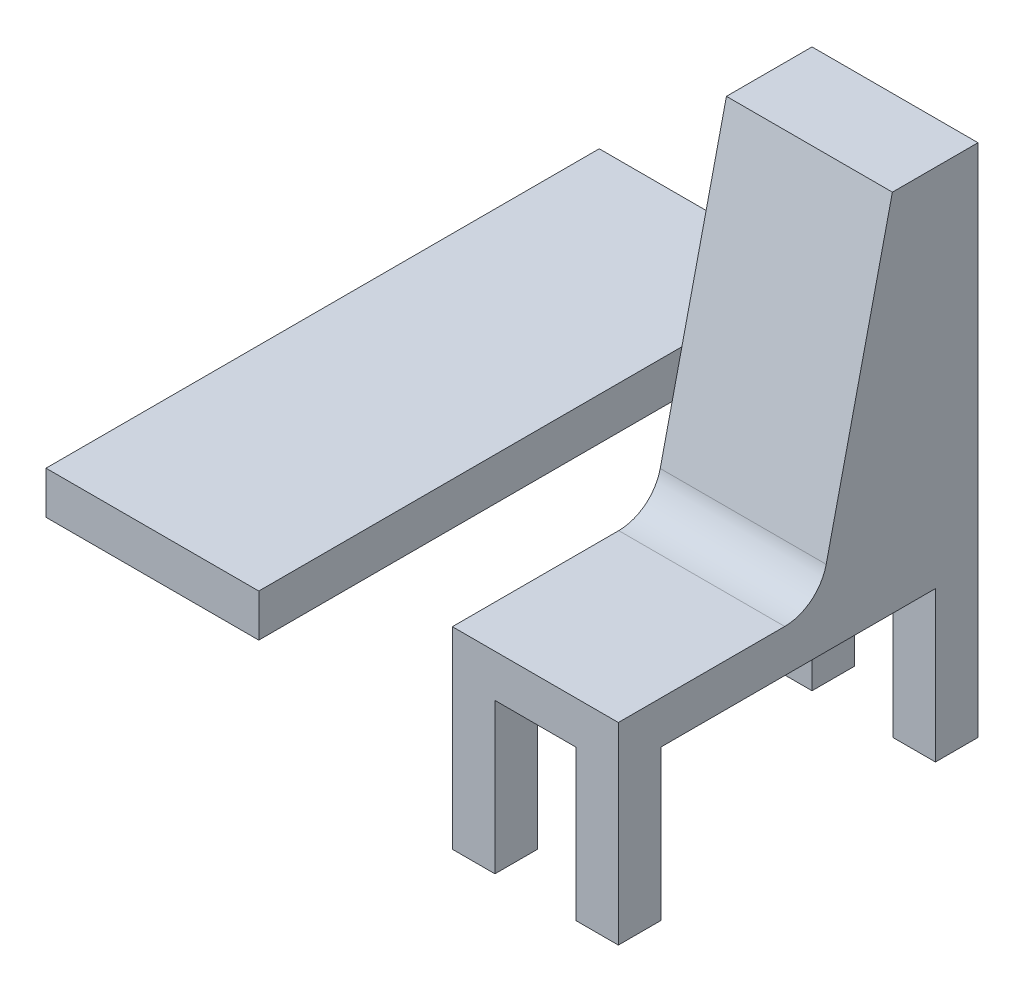
ISO-10303-21;
HEADER;
FILE_DESCRIPTION(('STEP AP214'),'2;1');
FILE_NAME('part.step','',(''),(''),'','','');
FILE_SCHEMA(('AUTOMOTIVE_DESIGN { 1 0 10303 214 1 1 1 1 }'));
ENDSEC;
DATA;
#1=APPLICATION_CONTEXT('core data for automotive mechanical design processes');
#2=APPLICATION_PROTOCOL_DEFINITION('international standard','automotive_design',2000,#1);
#3=PRODUCT_CONTEXT('',#1,'mechanical');
#4=PRODUCT('Part','Part','',(#3));
#5=PRODUCT_RELATED_PRODUCT_CATEGORY('part','',(#4));
#6=PRODUCT_DEFINITION_FORMATION('','',#4);
#7=PRODUCT_DEFINITION_CONTEXT('part definition',#1,'design');
#8=PRODUCT_DEFINITION('design','',#6,#7);
#9=PRODUCT_DEFINITION_SHAPE('','',#8);
#10=(LENGTH_UNIT() NAMED_UNIT(*) SI_UNIT(.MILLI.,.METRE.));
#11=(NAMED_UNIT(*) PLANE_ANGLE_UNIT() SI_UNIT($,.RADIAN.));
#12=(NAMED_UNIT(*) SI_UNIT($,.STERADIAN.) SOLID_ANGLE_UNIT());
#13=UNCERTAINTY_MEASURE_WITH_UNIT(LENGTH_MEASURE(1.E-05),#10,'distance_accuracy_value','');
#14=(GEOMETRIC_REPRESENTATION_CONTEXT(3) GLOBAL_UNCERTAINTY_ASSIGNED_CONTEXT((#13)) GLOBAL_UNIT_ASSIGNED_CONTEXT((#10,
#11,#12)) REPRESENTATION_CONTEXT('',''));
#15=CARTESIAN_POINT('',(0.,0.,0.));
#16=DIRECTION('',(0.,0.,1.));
#17=DIRECTION('',(1.,0.,0.));
#18=AXIS2_PLACEMENT_3D('',#15,#16,#17);
#19=CARTESIAN_POINT('',(-195.,0.,0.));
#20=DIRECTION('',(1.,0.,0.));
#21=DIRECTION('',(0.,0.,-1.));
#22=AXIS2_PLACEMENT_3D('',#19,#20,#21);
#23=PLANE('',#22);
#24=DIRECTION('',(0.,0.,-1.));
#25=VECTOR('',#24,1.);
#26=CARTESIAN_POINT('',(-195.,3.38208219918712,-455.543474797715));
#27=LINE('',#26,#25);
#28=CARTESIAN_POINT('',(-195.,3.38208219918712,-149.727423533533));
#29=VERTEX_POINT('',#28);
#30=CARTESIAN_POINT('',(-195.,3.38208219918712,-455.543474797715));
#31=VERTEX_POINT('',#30);
#32=EDGE_CURVE('E11',#29,#31,#27,.T.);
#33=ORIENTED_EDGE('',*,*,#32,.F.);
#34=DIRECTION('',(0.,-0.974799851771742,0.223081260947191));
#35=VECTOR('',#34,1.);
#36=CARTESIAN_POINT('',(-195.,460.678904739763,-254.379010845615));
#37=LINE('',#36,#35);
#38=CARTESIAN_POINT('',(-195.,460.678904739763,-254.379010845615));
#39=VERTEX_POINT('',#38);
#40=EDGE_CURVE('E307',#39,#29,#37,.T.);
#41=ORIENTED_EDGE('',*,*,#40,.F.);
#42=DIRECTION('',(0.,0.,1.));
#43=VECTOR('',#42,1.);
#44=CARTESIAN_POINT('',(-195.,460.678904739763,-455.543474797715));
#45=LINE('',#44,#43);
#46=CARTESIAN_POINT('',(-195.,460.678904739763,-455.543474797715));
#47=VERTEX_POINT('',#46);
#48=EDGE_CURVE('E274',#47,#39,#45,.T.);
#49=ORIENTED_EDGE('',*,*,#48,.F.);
#50=DIRECTION('',(0.,1.,0.));
#51=VECTOR('',#50,1.);
#52=CARTESIAN_POINT('',(-195.,-749.619649679448,-455.543474797715));
#53=LINE('',#52,#51);
#54=EDGE_CURVE('E50',#31,#47,#53,.T.);
#55=ORIENTED_EDGE('',*,*,#54,.F.);
#56=EDGE_LOOP('',(#33,#41,#49,#55));
#57=FACE_BOUND('',#56,.T.);
#58=ADVANCED_FACE('F33',(#57),#23,.F.);
#59=DIRECTION('',(0.,0.,1.));
#60=VECTOR('',#59,1.);
#61=CARTESIAN_POINT('',(-195.,-96.6179178008127,844.456525202285));
#62=LINE('',#61,#60);
#63=CARTESIAN_POINT('',(-195.,-96.6179178008129,-455.543474797715));
#64=VERTEX_POINT('',#63);
#65=CARTESIAN_POINT('',(-195.,-96.6179178008128,-126.842596402945));
#66=VERTEX_POINT('',#65);
#67=EDGE_CURVE('E57',#64,#66,#62,.T.);
#68=ORIENTED_EDGE('',*,*,#67,.F.);
#69=CARTESIAN_POINT('',(-195.,-749.619649679448,-455.543474797715));
#70=VERTEX_POINT('',#69);
#71=EDGE_CURVE('E219',#70,#64,#53,.T.);
#72=ORIENTED_EDGE('',*,*,#71,.F.);
#73=DIRECTION('',(0.,0.,-1.));
#74=VECTOR('',#73,1.);
#75=CARTESIAN_POINT('',(-195.,-749.619649679448,389.549913064427));
#76=LINE('',#75,#74);
#77=CARTESIAN_POINT('',(-195.,-749.619649679448,-355.543474797715));
#78=VERTEX_POINT('',#77);
#79=EDGE_CURVE('E316',#78,#70,#76,.T.);
#80=ORIENTED_EDGE('',*,*,#79,.F.);
#81=DIRECTION('',(0.,1.,0.));
#82=VECTOR('',#81,1.);
#83=CARTESIAN_POINT('',(-195.,0.,-355.543474797715));
#84=LINE('',#83,#82);
#85=CARTESIAN_POINT('',(-195.,-396.617917800813,-355.543474797715));
#86=VERTEX_POINT('',#85);
#87=EDGE_CURVE('E343',#78,#86,#84,.T.);
#88=ORIENTED_EDGE('',*,*,#87,.T.);
#89=DIRECTION('',(0.,0.,1.));
#90=VECTOR('',#89,1.);
#91=CARTESIAN_POINT('',(-195.,-396.617917800813,-1.02388511324065E-13));
#92=LINE('',#91,#90);
#93=CARTESIAN_POINT('',(-195.,-396.617917800813,289.549913064427));
#94=VERTEX_POINT('',#93);
#95=EDGE_CURVE('E340',#86,#94,#92,.T.);
#96=ORIENTED_EDGE('',*,*,#95,.T.);
#97=DIRECTION('',(0.,-1.,0.));
#98=VECTOR('',#97,1.);
#99=CARTESIAN_POINT('',(-195.,0.,289.549913064427));
#100=LINE('',#99,#98);
#101=CARTESIAN_POINT('',(-195.,-749.619649679448,289.549913064427));
#102=VERTEX_POINT('',#101);
#103=EDGE_CURVE('E337',#94,#102,#100,.T.);
#104=ORIENTED_EDGE('',*,*,#103,.T.);
#105=CARTESIAN_POINT('',(-195.,-749.619649679448,389.549913064427));
#106=VERTEX_POINT('',#105);
#107=EDGE_CURVE('E317',#106,#102,#76,.T.);
#108=ORIENTED_EDGE('',*,*,#107,.F.);
#109=DIRECTION('',(0.,-1.,0.));
#110=VECTOR('',#109,1.);
#111=CARTESIAN_POINT('',(-195.,-296.617917800813,389.549913064427));
#112=LINE('',#111,#110);
#113=CARTESIAN_POINT('',(-195.,-296.617917800813,389.549913064427));
#114=VERTEX_POINT('',#113);
#115=EDGE_CURVE('E313',#114,#106,#112,.T.);
#116=ORIENTED_EDGE('',*,*,#115,.F.);
#117=DIRECTION('',(0.,0.,1.));
#118=VECTOR('',#117,1.);
#119=CARTESIAN_POINT('',(-195.,-296.617917800813,-81.0729421417686));
#120=LINE('',#119,#118);
#121=CARTESIAN_POINT('',(-195.,-296.617917800813,-1.37260800233228));
#122=VERTEX_POINT('',#121);
#123=EDGE_CURVE('E310',#122,#114,#120,.T.);
#124=ORIENTED_EDGE('',*,*,#123,.F.);
#125=CARTESIAN_POINT('',(-195.,-196.617917800813,-1.37260800233227));
#126=DIRECTION('',(1.,0.,0.));
#127=DIRECTION('',(0.,0.,-1.));
#128=AXIS2_PLACEMENT_3D('',#125,#126,#127);
#129=CIRCLE('',#128,100.);
#130=CARTESIAN_POINT('',(-195.,-218.926043895532,-98.8525931795066));
#131=VERTEX_POINT('',#130);
#132=EDGE_CURVE('E351',#122,#131,#129,.T.);
#133=ORIENTED_EDGE('',*,*,#132,.T.);
#134=EDGE_CURVE('E306',#66,#131,#37,.T.);
#135=ORIENTED_EDGE('',*,*,#134,.F.);
#136=EDGE_LOOP('',(#68,#72,#80,#88,#96,#104,#108,#116,#124,#133,#135));
#137=FACE_BOUND('',#136,.T.);
#138=ADVANCED_FACE('F372',(#137),#23,.F.);
#139=CARTESIAN_POINT('',(195.,-749.619649679448,389.549913064427));
#140=DIRECTION('',(0.,1.,0.));
#141=DIRECTION('',(0.,0.,1.));
#142=AXIS2_PLACEMENT_3D('',#139,#140,#141);
#143=PLANE('',#142);
#144=DIRECTION('',(-1.,0.,0.));
#145=VECTOR('',#144,1.);
#146=CARTESIAN_POINT('',(195.,-749.619649679448,-455.543474797715));
#147=LINE('',#146,#145);
#148=CARTESIAN_POINT('',(-95.0000000000001,-749.619649679448,-455.543474797715));
#149=VERTEX_POINT('',#148);
#150=EDGE_CURVE('E323',#149,#70,#147,.T.);
#151=ORIENTED_EDGE('',*,*,#150,.F.);
#152=DIRECTION('',(0.,0.,-1.));
#153=VECTOR('',#152,1.);
#154=CARTESIAN_POINT('',(-95.0000000000001,-749.619649679448,389.549913064427));
#155=LINE('',#154,#153);
#156=CARTESIAN_POINT('',(-95.0000000000001,-749.619649679448,-355.543474797715));
#157=VERTEX_POINT('',#156);
#158=EDGE_CURVE('E238',#157,#149,#155,.T.);
#159=ORIENTED_EDGE('',*,*,#158,.F.);
#160=DIRECTION('',(-1.,0.,0.));
#161=VECTOR('',#160,1.);
#162=CARTESIAN_POINT('',(195.,-749.619649679448,-355.543474797715));
#163=LINE('',#162,#161);
#164=EDGE_CURVE('E270',#157,#78,#163,.T.);
#165=ORIENTED_EDGE('',*,*,#164,.T.);
#166=ORIENTED_EDGE('',*,*,#79,.T.);
#167=EDGE_LOOP('',(#151,#159,#165,#166));
#168=FACE_BOUND('',#167,.T.);
#169=ADVANCED_FACE('F440',(#168),#143,.F.);
#170=DIRECTION('',(-1.,0.,0.));
#171=VECTOR('',#170,1.);
#172=CARTESIAN_POINT('',(195.,-749.619649679448,289.549913064427));
#173=LINE('',#172,#171);
#174=CARTESIAN_POINT('',(-95.0000000000001,-749.619649679448,289.549913064427));
#175=VERTEX_POINT('',#174);
#176=EDGE_CURVE('E283',#175,#102,#173,.T.);
#177=ORIENTED_EDGE('',*,*,#176,.F.);
#178=CARTESIAN_POINT('',(-95.0000000000001,-749.619649679448,389.549913064427));
#179=VERTEX_POINT('',#178);
#180=EDGE_CURVE('E235',#179,#175,#155,.T.);
#181=ORIENTED_EDGE('',*,*,#180,.F.);
#182=DIRECTION('',(-1.,0.,0.));
#183=VECTOR('',#182,1.);
#184=CARTESIAN_POINT('',(195.,-749.619649679448,389.549913064427));
#185=LINE('',#184,#183);
#186=EDGE_CURVE('E327',#179,#106,#185,.T.);
#187=ORIENTED_EDGE('',*,*,#186,.T.);
#188=ORIENTED_EDGE('',*,*,#107,.T.);
#189=EDGE_LOOP('',(#177,#181,#187,#188));
#190=FACE_BOUND('',#189,.T.);
#191=ADVANCED_FACE('F368',(#190),#143,.F.);
#192=CARTESIAN_POINT('',(195.,-749.619649679448,-355.543474797715));
#193=DIRECTION('',(0.,0.,-1.));
#194=DIRECTION('',(0.,1.,0.));
#195=AXIS2_PLACEMENT_3D('',#192,#193,#194);
#196=PLANE('',#195);
#197=ORIENTED_EDGE('',*,*,#164,.F.);
#198=DIRECTION('',(0.,1.,0.));
#199=VECTOR('',#198,1.);
#200=CARTESIAN_POINT('',(-95.0000000000001,-749.619649679448,-355.543474797715));
#201=LINE('',#200,#199);
#202=CARTESIAN_POINT('',(-95.0000000000001,-396.617917800813,-355.543474797715));
#203=VERTEX_POINT('',#202);
#204=EDGE_CURVE('E255',#157,#203,#201,.T.);
#205=ORIENTED_EDGE('',*,*,#204,.T.);
#206=DIRECTION('',(-1.,0.,0.));
#207=VECTOR('',#206,1.);
#208=CARTESIAN_POINT('',(195.,-396.617917800813,-355.543474797715));
#209=LINE('',#208,#207);
#210=EDGE_CURVE('E275',#203,#86,#209,.T.);
#211=ORIENTED_EDGE('',*,*,#210,.T.);
#212=ORIENTED_EDGE('',*,*,#87,.F.);
#213=EDGE_LOOP('',(#197,#205,#211,#212));
#214=FACE_BOUND('',#213,.T.);
#215=ADVANCED_FACE('F465',(#214),#196,.F.);
#216=CARTESIAN_POINT('',(195.,-749.619649679448,289.549913064427));
#217=DIRECTION('',(0.,0.,1.));
#218=DIRECTION('',(1.,0.,0.));
#219=AXIS2_PLACEMENT_3D('',#216,#217,#218);
#220=PLANE('',#219);
#221=DIRECTION('',(-1.,0.,0.));
#222=VECTOR('',#221,1.);
#223=CARTESIAN_POINT('',(195.,-396.617917800813,289.549913064427));
#224=LINE('',#223,#222);
#225=CARTESIAN_POINT('',(-95.0000000000001,-396.617917800813,289.549913064427));
#226=VERTEX_POINT('',#225);
#227=EDGE_CURVE('E279',#226,#94,#224,.T.);
#228=ORIENTED_EDGE('',*,*,#227,.F.);
#229=DIRECTION('',(0.,-1.,0.));
#230=VECTOR('',#229,1.);
#231=CARTESIAN_POINT('',(-95.0000000000001,-749.619649679448,289.549913064427));
#232=LINE('',#231,#230);
#233=EDGE_CURVE('E37',#226,#175,#232,.T.);
#234=ORIENTED_EDGE('',*,*,#233,.T.);
#235=ORIENTED_EDGE('',*,*,#176,.T.);
#236=ORIENTED_EDGE('',*,*,#103,.F.);
#237=EDGE_LOOP('',(#228,#234,#235,#236));
#238=FACE_BOUND('',#237,.T.);
#239=ADVANCED_FACE('F363',(#238),#220,.F.);
#240=CARTESIAN_POINT('',(195.,-749.619649679448,-355.543474797715));
#241=VERTEX_POINT('',#240);
#242=CARTESIAN_POINT('',(95.0000000000001,-749.619649679448,-355.543474797715));
#243=VERTEX_POINT('',#242);
#244=EDGE_CURVE('E284',#241,#243,#163,.T.);
#245=ORIENTED_EDGE('',*,*,#244,.T.);
#246=DIRECTION('',(0.,0.,-1.));
#247=VECTOR('',#246,1.);
#248=CARTESIAN_POINT('',(95.0000000000001,-749.619649679448,389.549913064427));
#249=LINE('',#248,#247);
#250=CARTESIAN_POINT('',(95.0000000000001,-749.619649679448,-455.543474797715));
#251=VERTEX_POINT('',#250);
#252=EDGE_CURVE('E242',#243,#251,#249,.T.);
#253=ORIENTED_EDGE('',*,*,#252,.T.);
#254=CARTESIAN_POINT('',(195.,-749.619649679448,-455.543474797715));
#255=VERTEX_POINT('',#254);
#256=EDGE_CURVE('E324',#255,#251,#147,.T.);
#257=ORIENTED_EDGE('',*,*,#256,.F.);
#258=DIRECTION('',(0.,0.,-1.));
#259=VECTOR('',#258,1.);
#260=CARTESIAN_POINT('',(195.,-749.619649679448,389.549913064427));
#261=LINE('',#260,#259);
#262=EDGE_CURVE('E297',#241,#255,#261,.T.);
#263=ORIENTED_EDGE('',*,*,#262,.F.);
#264=EDGE_LOOP('',(#245,#253,#257,#263));
#265=FACE_BOUND('',#264,.T.);
#266=ADVANCED_FACE('F450',(#265),#143,.F.);
#267=CARTESIAN_POINT('',(195.,460.678904739763,-455.543474797715));
#268=DIRECTION('',(0.,-1.,0.));
#269=DIRECTION('',(0.,0.,-1.));
#270=AXIS2_PLACEMENT_3D('',#267,#268,#269);
#271=PLANE('',#270);
#272=ORIENTED_EDGE('',*,*,#48,.T.);
#273=DIRECTION('',(-1.,0.,0.));
#274=VECTOR('',#273,1.);
#275=CARTESIAN_POINT('',(195.,460.678904739763,-254.379010845615));
#276=LINE('',#275,#274);
#277=CARTESIAN_POINT('',(195.,460.678904739763,-254.379010845615));
#278=VERTEX_POINT('',#277);
#279=EDGE_CURVE('E334',#278,#39,#276,.T.);
#280=ORIENTED_EDGE('',*,*,#279,.F.);
#281=DIRECTION('',(0.,0.,1.));
#282=VECTOR('',#281,1.);
#283=CARTESIAN_POINT('',(195.,460.678904739763,-455.543474797715));
#284=LINE('',#283,#282);
#285=CARTESIAN_POINT('',(195.,460.678904739763,-455.543474797715));
#286=VERTEX_POINT('',#285);
#287=EDGE_CURVE('E287',#286,#278,#284,.T.);
#288=ORIENTED_EDGE('',*,*,#287,.F.);
#289=DIRECTION('',(-1.,0.,0.));
#290=VECTOR('',#289,1.);
#291=CARTESIAN_POINT('',(195.,460.678904739763,-455.543474797715));
#292=LINE('',#291,#290);
#293=EDGE_CURVE('E303',#286,#47,#292,.T.);
#294=ORIENTED_EDGE('',*,*,#293,.T.);
#295=EDGE_LOOP('',(#272,#280,#288,#294));
#296=FACE_BOUND('',#295,.T.);
#297=ADVANCED_FACE('F405',(#296),#271,.F.);
#298=CARTESIAN_POINT('',(195.,460.678904739763,-254.379010845615));
#299=DIRECTION('',(0.,-0.223081260947191,-0.974799851771743));
#300=DIRECTION('',(0.,0.974799851771743,-0.223081260947191));
#301=AXIS2_PLACEMENT_3D('',#298,#299,#300);
#302=PLANE('',#301);
#303=ORIENTED_EDGE('',*,*,#40,.T.);
#304=EDGE_CURVE('E311',#29,#66,#37,.T.);
#305=ORIENTED_EDGE('',*,*,#304,.T.);
#306=ORIENTED_EDGE('',*,*,#134,.T.);
#307=DIRECTION('',(-1.,0.,0.));
#308=VECTOR('',#307,1.);
#309=CARTESIAN_POINT('',(195.,-218.926043895532,-98.8525931795065));
#310=LINE('',#309,#308);
#311=CARTESIAN_POINT('',(195.,-218.926043895532,-98.8525931795066));
#312=VERTEX_POINT('',#311);
#313=EDGE_CURVE('E349',#131,#312,#310,.F.);
#314=ORIENTED_EDGE('',*,*,#313,.T.);
#315=DIRECTION('',(0.,-0.974799851771742,0.223081260947191));
#316=VECTOR('',#315,1.);
#317=CARTESIAN_POINT('',(195.,460.678904739763,-254.379010845615));
#318=LINE('',#317,#316);
#319=EDGE_CURVE('E290',#278,#312,#318,.T.);
#320=ORIENTED_EDGE('',*,*,#319,.F.);
#321=ORIENTED_EDGE('',*,*,#279,.T.);
#322=EDGE_LOOP('',(#303,#305,#306,#314,#320,#321));
#323=FACE_BOUND('',#322,.T.);
#324=ADVANCED_FACE('F397',(#323),#302,.F.);
#325=CARTESIAN_POINT('',(195.,-296.617917800813,-81.0729421417686));
#326=DIRECTION('',(0.,-1.,0.));
#327=DIRECTION('',(0.,0.,-1.));
#328=AXIS2_PLACEMENT_3D('',#325,#326,#327);
#329=PLANE('',#328);
#330=DIRECTION('',(0.,0.,1.));
#331=VECTOR('',#330,1.);
#332=CARTESIAN_POINT('',(195.,-296.617917800813,-81.0729421417686));
#333=LINE('',#332,#331);
#334=CARTESIAN_POINT('',(195.,-296.617917800813,-1.37260800233228));
#335=VERTEX_POINT('',#334);
#336=CARTESIAN_POINT('',(195.,-296.617917800813,389.549913064427));
#337=VERTEX_POINT('',#336);
#338=EDGE_CURVE('E293',#335,#337,#333,.T.);
#339=ORIENTED_EDGE('',*,*,#338,.F.);
#340=DIRECTION('',(-1.,0.,0.));
#341=VECTOR('',#340,1.);
#342=CARTESIAN_POINT('',(-195.,-296.617917800813,-1.37260800233228));
#343=LINE('',#342,#341);
#344=EDGE_CURVE('E346',#335,#122,#343,.T.);
#345=ORIENTED_EDGE('',*,*,#344,.T.);
#346=ORIENTED_EDGE('',*,*,#123,.T.);
#347=DIRECTION('',(-1.,0.,0.));
#348=VECTOR('',#347,1.);
#349=CARTESIAN_POINT('',(195.,-296.617917800813,389.549913064427));
#350=LINE('',#349,#348);
#351=EDGE_CURVE('E331',#337,#114,#350,.T.);
#352=ORIENTED_EDGE('',*,*,#351,.F.);
#353=EDGE_LOOP('',(#339,#345,#346,#352));
#354=FACE_BOUND('',#353,.T.);
#355=ADVANCED_FACE('F390',(#354),#329,.F.);
#356=CARTESIAN_POINT('',(195.,-296.617917800813,389.549913064427));
#357=DIRECTION('',(0.,0.,-1.));
#358=DIRECTION('',(0.,1.,0.));
#359=AXIS2_PLACEMENT_3D('',#356,#357,#358);
#360=PLANE('',#359);
#361=ORIENTED_EDGE('',*,*,#186,.F.);
#362=DIRECTION('',(0.,1.,0.));
#363=VECTOR('',#362,1.);
#364=CARTESIAN_POINT('',(-95.0000000000001,-749.619649679448,389.549913064427));
#365=LINE('',#364,#363);
#366=CARTESIAN_POINT('',(-95.0000000000001,-396.617917800813,389.549913064427));
#367=VERTEX_POINT('',#366);
#368=EDGE_CURVE('E220',#179,#367,#365,.T.);
#369=ORIENTED_EDGE('',*,*,#368,.T.);
#370=DIRECTION('',(1.,0.,0.));
#371=VECTOR('',#370,1.);
#372=CARTESIAN_POINT('',(95.0000000000001,-396.617917800813,389.549913064427));
#373=LINE('',#372,#371);
#374=CARTESIAN_POINT('',(95.0000000000001,-396.617917800813,389.549913064427));
#375=VERTEX_POINT('',#374);
#376=EDGE_CURVE('E223',#367,#375,#373,.T.);
#377=ORIENTED_EDGE('',*,*,#376,.T.);
#378=DIRECTION('',(0.,-1.,0.));
#379=VECTOR('',#378,1.);
#380=CARTESIAN_POINT('',(95.0000000000001,-749.619649679448,389.549913064427));
#381=LINE('',#380,#379);
#382=CARTESIAN_POINT('',(95.0000000000001,-749.619649679448,389.549913064427));
#383=VERTEX_POINT('',#382);
#384=EDGE_CURVE('E231',#375,#383,#381,.T.);
#385=ORIENTED_EDGE('',*,*,#384,.T.);
#386=CARTESIAN_POINT('',(195.,-749.619649679448,389.549913064427));
#387=VERTEX_POINT('',#386);
#388=EDGE_CURVE('E328',#387,#383,#185,.T.);
#389=ORIENTED_EDGE('',*,*,#388,.F.);
#390=DIRECTION('',(0.,-1.,0.));
#391=VECTOR('',#390,1.);
#392=CARTESIAN_POINT('',(195.,-296.617917800813,389.549913064427));
#393=LINE('',#392,#391);
#394=EDGE_CURVE('E295',#337,#387,#393,.T.);
#395=ORIENTED_EDGE('',*,*,#394,.F.);
#396=ORIENTED_EDGE('',*,*,#351,.T.);
#397=ORIENTED_EDGE('',*,*,#115,.T.);
#398=EDGE_LOOP('',(#361,#369,#377,#385,#389,#395,#396,#397));
#399=FACE_BOUND('',#398,.T.);
#400=ADVANCED_FACE('F384',(#399),#360,.F.);
#401=ORIENTED_EDGE('',*,*,#388,.T.);
#402=CARTESIAN_POINT('',(95.0000000000001,-749.619649679448,289.549913064427));
#403=VERTEX_POINT('',#402);
#404=EDGE_CURVE('E239',#383,#403,#249,.T.);
#405=ORIENTED_EDGE('',*,*,#404,.T.);
#406=CARTESIAN_POINT('',(195.,-749.619649679448,289.549913064427));
#407=VERTEX_POINT('',#406);
#408=EDGE_CURVE('E280',#407,#403,#173,.T.);
#409=ORIENTED_EDGE('',*,*,#408,.F.);
#410=EDGE_CURVE('E298',#387,#407,#261,.T.);
#411=ORIENTED_EDGE('',*,*,#410,.F.);
#412=EDGE_LOOP('',(#401,#405,#409,#411));
#413=FACE_BOUND('',#412,.T.);
#414=ADVANCED_FACE('F446',(#413),#143,.F.);
#415=CARTESIAN_POINT('',(195.,-749.619649679448,-455.543474797715));
#416=DIRECTION('',(0.,0.,1.));
#417=DIRECTION('',(1.,0.,0.));
#418=AXIS2_PLACEMENT_3D('',#415,#416,#417);
#419=PLANE('',#418);
#420=DIRECTION('',(-1.,0.,0.));
#421=VECTOR('',#420,1.);
#422=CARTESIAN_POINT('',(195.,-396.617917800813,-455.543474797715));
#423=LINE('',#422,#421);
#424=CARTESIAN_POINT('',(95.0000000000001,-396.617917800813,-455.543474797715));
#425=VERTEX_POINT('',#424);
#426=CARTESIAN_POINT('',(-95.0000000000001,-396.617917800813,-455.543474797715));
#427=VERTEX_POINT('',#426);
#428=EDGE_CURVE('E237',#425,#427,#423,.T.);
#429=ORIENTED_EDGE('',*,*,#428,.T.);
#430=DIRECTION('',(0.,-1.,0.));
#431=VECTOR('',#430,1.);
#432=CARTESIAN_POINT('',(-95.0000000000001,-749.619649679448,-455.543474797715));
#433=LINE('',#432,#431);
#434=EDGE_CURVE('E258',#427,#149,#433,.T.);
#435=ORIENTED_EDGE('',*,*,#434,.T.);
#436=ORIENTED_EDGE('',*,*,#150,.T.);
#437=ORIENTED_EDGE('',*,*,#71,.T.);
#438=DIRECTION('',(1.,0.,0.));
#439=VECTOR('',#438,1.);
#440=CARTESIAN_POINT('',(-695.,-96.6179178008129,-455.543474797715));
#441=LINE('',#440,#439);
#442=CARTESIAN_POINT('',(-695.,-96.6179178008129,-455.543474797715));
#443=VERTEX_POINT('',#442);
#444=EDGE_CURVE('E201',#443,#64,#441,.T.);
#445=ORIENTED_EDGE('',*,*,#444,.F.);
#446=DIRECTION('',(0.,-1.,0.));
#447=VECTOR('',#446,1.);
#448=CARTESIAN_POINT('',(-695.,-96.6179178008129,-455.543474797715));
#449=LINE('',#448,#447);
#450=CARTESIAN_POINT('',(-695.,3.38208219918712,-455.543474797715));
#451=VERTEX_POINT('',#450);
#452=EDGE_CURVE('E207',#451,#443,#449,.T.);
#453=ORIENTED_EDGE('',*,*,#452,.F.);
#454=DIRECTION('',(1.,0.,0.));
#455=VECTOR('',#454,1.);
#456=CARTESIAN_POINT('',(-695.,3.38208219918712,-455.543474797715));
#457=LINE('',#456,#455);
#458=EDGE_CURVE('E421',#451,#31,#457,.T.);
#459=ORIENTED_EDGE('',*,*,#458,.T.);
#460=ORIENTED_EDGE('',*,*,#54,.T.);
#461=ORIENTED_EDGE('',*,*,#293,.F.);
#462=DIRECTION('',(0.,1.,0.));
#463=VECTOR('',#462,1.);
#464=CARTESIAN_POINT('',(195.,-749.619649679448,-455.543474797715));
#465=LINE('',#464,#463);
#466=EDGE_CURVE('E301',#255,#286,#465,.T.);
#467=ORIENTED_EDGE('',*,*,#466,.F.);
#468=ORIENTED_EDGE('',*,*,#256,.T.);
#469=DIRECTION('',(0.,1.,0.));
#470=VECTOR('',#469,1.);
#471=CARTESIAN_POINT('',(95.0000000000001,-749.619649679448,-455.543474797715));
#472=LINE('',#471,#470);
#473=EDGE_CURVE('E252',#251,#425,#472,.T.);
#474=ORIENTED_EDGE('',*,*,#473,.T.);
#475=EDGE_LOOP('',(#429,#435,#436,#437,#445,#453,#459,#460,#461,#467,#468,#474));
#476=FACE_BOUND('',#475,.T.);
#477=ADVANCED_FACE('F218',(#476),#419,.F.);
#478=CARTESIAN_POINT('',(195.,0.,0.));
#479=DIRECTION('',(1.,0.,0.));
#480=DIRECTION('',(0.,0.,-1.));
#481=AXIS2_PLACEMENT_3D('',#478,#479,#480);
#482=PLANE('',#481);
#483=DIRECTION('',(0.,-1.,0.));
#484=VECTOR('',#483,1.);
#485=CARTESIAN_POINT('',(195.,-749.619649679448,-355.543474797715));
#486=LINE('',#485,#484);
#487=CARTESIAN_POINT('',(195.,-396.617917800813,-355.543474797715));
#488=VERTEX_POINT('',#487);
#489=EDGE_CURVE('E261',#488,#241,#486,.T.);
#490=ORIENTED_EDGE('',*,*,#489,.T.);
#491=ORIENTED_EDGE('',*,*,#262,.T.);
#492=ORIENTED_EDGE('',*,*,#466,.T.);
#493=ORIENTED_EDGE('',*,*,#287,.T.);
#494=ORIENTED_EDGE('',*,*,#319,.T.);
#495=CARTESIAN_POINT('',(195.,-196.617917800813,-1.37260800233227));
#496=DIRECTION('',(1.,0.,0.));
#497=DIRECTION('',(0.,0.,-1.));
#498=AXIS2_PLACEMENT_3D('',#495,#496,#497);
#499=CIRCLE('',#498,100.);
#500=EDGE_CURVE('E354',#312,#335,#499,.F.);
#501=ORIENTED_EDGE('',*,*,#500,.T.);
#502=ORIENTED_EDGE('',*,*,#338,.T.);
#503=ORIENTED_EDGE('',*,*,#394,.T.);
#504=ORIENTED_EDGE('',*,*,#410,.T.);
#505=DIRECTION('',(0.,1.,0.));
#506=VECTOR('',#505,1.);
#507=CARTESIAN_POINT('',(195.,-749.619649679448,289.549913064427));
#508=LINE('',#507,#506);
#509=CARTESIAN_POINT('',(195.,-396.617917800813,289.549913064427));
#510=VERTEX_POINT('',#509);
#511=EDGE_CURVE('E264',#407,#510,#508,.T.);
#512=ORIENTED_EDGE('',*,*,#511,.T.);
#513=DIRECTION('',(0.,0.,-1.));
#514=VECTOR('',#513,1.);
#515=CARTESIAN_POINT('',(195.,-396.617917800813,-355.543474797715));
#516=LINE('',#515,#514);
#517=EDGE_CURVE('E267',#510,#488,#516,.T.);
#518=ORIENTED_EDGE('',*,*,#517,.T.);
#519=EDGE_LOOP('',(#490,#491,#492,#493,#494,#501,#502,#503,#504,#512,#518));
#520=FACE_BOUND('',#519,.T.);
#521=ADVANCED_FACE('F399',(#520),#482,.T.);
#522=CARTESIAN_POINT('',(95.0000000000001,-396.617917800813,-355.543474797715));
#523=VERTEX_POINT('',#522);
#524=EDGE_CURVE('E271',#488,#523,#209,.T.);
#525=ORIENTED_EDGE('',*,*,#524,.T.);
#526=DIRECTION('',(0.,-1.,0.));
#527=VECTOR('',#526,1.);
#528=CARTESIAN_POINT('',(95.0000000000001,-749.619649679448,-355.543474797715));
#529=LINE('',#528,#527);
#530=EDGE_CURVE('E249',#523,#243,#529,.T.);
#531=ORIENTED_EDGE('',*,*,#530,.T.);
#532=ORIENTED_EDGE('',*,*,#244,.F.);
#533=ORIENTED_EDGE('',*,*,#489,.F.);
#534=EDGE_LOOP('',(#525,#531,#532,#533));
#535=FACE_BOUND('',#534,.T.);
#536=ADVANCED_FACE('F474',(#535),#196,.F.);
#537=CARTESIAN_POINT('',(195.,-396.617917800813,-355.543474797715));
#538=DIRECTION('',(0.,1.,0.));
#539=DIRECTION('',(0.,0.,1.));
#540=AXIS2_PLACEMENT_3D('',#537,#538,#539);
#541=PLANE('',#540);
#542=CARTESIAN_POINT('',(95.0000000000001,-396.617917800813,289.549913064427));
#543=VERTEX_POINT('',#542);
#544=EDGE_CURVE('E276',#510,#543,#224,.T.);
#545=ORIENTED_EDGE('',*,*,#544,.T.);
#546=DIRECTION('',(0.,0.,-1.));
#547=VECTOR('',#546,1.);
#548=CARTESIAN_POINT('',(95.0000000000001,-396.617917800813,389.549913064427));
#549=LINE('',#548,#547);
#550=EDGE_CURVE('E243',#375,#543,#549,.T.);
#551=ORIENTED_EDGE('',*,*,#550,.F.);
#552=ORIENTED_EDGE('',*,*,#376,.F.);
#553=DIRECTION('',(0.,0.,-1.));
#554=VECTOR('',#553,1.);
#555=CARTESIAN_POINT('',(-95.0000000000001,-396.617917800813,389.549913064427));
#556=LINE('',#555,#554);
#557=EDGE_CURVE('E246',#367,#226,#556,.T.);
#558=ORIENTED_EDGE('',*,*,#557,.T.);
#559=ORIENTED_EDGE('',*,*,#227,.T.);
#560=ORIENTED_EDGE('',*,*,#95,.F.);
#561=ORIENTED_EDGE('',*,*,#210,.F.);
#562=EDGE_CURVE('E234',#203,#427,#556,.T.);
#563=ORIENTED_EDGE('',*,*,#562,.T.);
#564=ORIENTED_EDGE('',*,*,#428,.F.);
#565=EDGE_CURVE('E245',#523,#425,#549,.T.);
#566=ORIENTED_EDGE('',*,*,#565,.F.);
#567=ORIENTED_EDGE('',*,*,#524,.F.);
#568=ORIENTED_EDGE('',*,*,#517,.F.);
#569=EDGE_LOOP('',(#545,#551,#552,#558,#559,#560,#561,#563,#564,#566,#567,#568));
#570=FACE_BOUND('',#569,.T.);
#571=ADVANCED_FACE('F379',(#570),#541,.F.);
#572=ORIENTED_EDGE('',*,*,#408,.T.);
#573=DIRECTION('',(0.,1.,0.));
#574=VECTOR('',#573,1.);
#575=CARTESIAN_POINT('',(95.0000000000001,-749.619649679448,289.549913064427));
#576=LINE('',#575,#574);
#577=EDGE_CURVE('E355',#403,#543,#576,.T.);
#578=ORIENTED_EDGE('',*,*,#577,.T.);
#579=ORIENTED_EDGE('',*,*,#544,.F.);
#580=ORIENTED_EDGE('',*,*,#511,.F.);
#581=EDGE_LOOP('',(#572,#578,#579,#580));
#582=FACE_BOUND('',#581,.T.);
#583=ADVANCED_FACE('F467',(#582),#220,.F.);
#584=CARTESIAN_POINT('',(195.,-196.617917800813,-1.37260800233227));
#585=DIRECTION('',(1.,0.,0.));
#586=DIRECTION('',(0.,0.,-1.));
#587=AXIS2_PLACEMENT_3D('',#584,#585,#586);
#588=CYLINDRICAL_SURFACE('',#587,100.);
#589=ORIENTED_EDGE('',*,*,#500,.F.);
#590=ORIENTED_EDGE('',*,*,#313,.F.);
#591=ORIENTED_EDGE('',*,*,#132,.F.);
#592=ORIENTED_EDGE('',*,*,#344,.F.);
#593=EDGE_LOOP('',(#589,#590,#591,#592));
#594=FACE_BOUND('',#593,.T.);
#595=ADVANCED_FACE('F35',(#594),#588,.F.);
#596=CARTESIAN_POINT('',(95.0000000000001,-749.619649679448,389.549913064427));
#597=DIRECTION('',(1.,0.,0.));
#598=DIRECTION('',(0.,1.,0.));
#599=AXIS2_PLACEMENT_3D('',#596,#597,#598);
#600=PLANE('',#599);
#601=ORIENTED_EDGE('',*,*,#404,.F.);
#602=ORIENTED_EDGE('',*,*,#384,.F.);
#603=ORIENTED_EDGE('',*,*,#550,.T.);
#604=ORIENTED_EDGE('',*,*,#577,.F.);
#605=EDGE_LOOP('',(#601,#602,#603,#604));
#606=FACE_BOUND('',#605,.T.);
#607=ADVANCED_FACE('F498',(#606),#600,.F.);
#608=CARTESIAN_POINT('',(-95.0000000000001,-749.619649679448,389.549913064427));
#609=DIRECTION('',(-1.,0.,0.));
#610=DIRECTION('',(0.,0.,1.));
#611=AXIS2_PLACEMENT_3D('',#608,#609,#610);
#612=PLANE('',#611);
#613=ORIENTED_EDGE('',*,*,#557,.F.);
#614=ORIENTED_EDGE('',*,*,#368,.F.);
#615=ORIENTED_EDGE('',*,*,#180,.T.);
#616=ORIENTED_EDGE('',*,*,#233,.F.);
#617=EDGE_LOOP('',(#613,#614,#615,#616));
#618=FACE_BOUND('',#617,.T.);
#619=ADVANCED_FACE('F382',(#618),#612,.F.);
#620=ORIENTED_EDGE('',*,*,#562,.F.);
#621=ORIENTED_EDGE('',*,*,#204,.F.);
#622=ORIENTED_EDGE('',*,*,#158,.T.);
#623=ORIENTED_EDGE('',*,*,#434,.F.);
#624=EDGE_LOOP('',(#620,#621,#622,#623));
#625=FACE_BOUND('',#624,.T.);
#626=ADVANCED_FACE('F483',(#625),#612,.F.);
#627=ORIENTED_EDGE('',*,*,#252,.F.);
#628=ORIENTED_EDGE('',*,*,#530,.F.);
#629=ORIENTED_EDGE('',*,*,#565,.T.);
#630=ORIENTED_EDGE('',*,*,#473,.F.);
#631=EDGE_LOOP('',(#627,#628,#629,#630));
#632=FACE_BOUND('',#631,.T.);
#633=ADVANCED_FACE('F487',(#632),#600,.F.);
#634=CARTESIAN_POINT('',(-195.,0.,0.));
#635=DIRECTION('',(1.,0.,0.));
#636=DIRECTION('',(0.,0.,-1.));
#637=AXIS2_PLACEMENT_3D('',#634,#635,#636);
#638=PLANE('',#637);
#639=ORIENTED_EDGE('',*,*,#304,.F.);
#640=CARTESIAN_POINT('',(-195.,3.38208219918712,844.456525202285));
#641=VERTEX_POINT('',#640);
#642=EDGE_CURVE('E43',#641,#29,#27,.T.);
#643=ORIENTED_EDGE('',*,*,#642,.F.);
#644=DIRECTION('',(0.,1.,0.));
#645=VECTOR('',#644,1.);
#646=CARTESIAN_POINT('',(-195.,3.38208219918712,844.456525202285));
#647=LINE('',#646,#645);
#648=CARTESIAN_POINT('',(-195.,-96.6179178008127,844.456525202285));
#649=VERTEX_POINT('',#648);
#650=EDGE_CURVE('E417',#649,#641,#647,.T.);
#651=ORIENTED_EDGE('',*,*,#650,.F.);
#652=EDGE_CURVE('E412',#66,#649,#62,.T.);
#653=ORIENTED_EDGE('',*,*,#652,.F.);
#654=EDGE_LOOP('',(#639,#643,#651,#653));
#655=FACE_BOUND('',#654,.T.);
#656=ADVANCED_FACE('F410',(#655),#638,.T.);
#657=CARTESIAN_POINT('',(-695.,-96.6179178008127,844.456525202285));
#658=DIRECTION('',(0.,1.,0.));
#659=DIRECTION('',(0.,0.,1.));
#660=AXIS2_PLACEMENT_3D('',#657,#658,#659);
#661=PLANE('',#660);
#662=ORIENTED_EDGE('',*,*,#67,.T.);
#663=ORIENTED_EDGE('',*,*,#652,.T.);
#664=DIRECTION('',(1.,0.,0.));
#665=VECTOR('',#664,1.);
#666=CARTESIAN_POINT('',(-695.,-96.6179178008127,844.456525202285));
#667=LINE('',#666,#665);
#668=CARTESIAN_POINT('',(-695.,-96.6179178008127,844.456525202285));
#669=VERTEX_POINT('',#668);
#670=EDGE_CURVE('E203',#669,#649,#667,.T.);
#671=ORIENTED_EDGE('',*,*,#670,.F.);
#672=DIRECTION('',(0.,0.,1.));
#673=VECTOR('',#672,1.);
#674=CARTESIAN_POINT('',(-695.,-96.6179178008127,844.456525202285));
#675=LINE('',#674,#673);
#676=EDGE_CURVE('E197',#443,#669,#675,.T.);
#677=ORIENTED_EDGE('',*,*,#676,.F.);
#678=ORIENTED_EDGE('',*,*,#444,.T.);
#679=EDGE_LOOP('',(#662,#663,#671,#677,#678));
#680=FACE_BOUND('',#679,.T.);
#681=ADVANCED_FACE('F199',(#680),#661,.F.);
#682=CARTESIAN_POINT('',(-695.,3.38208219918712,844.456525202285));
#683=DIRECTION('',(0.,0.,-1.));
#684=DIRECTION('',(-1.,0.,0.));
#685=AXIS2_PLACEMENT_3D('',#682,#683,#684);
#686=PLANE('',#685);
#687=ORIENTED_EDGE('',*,*,#650,.T.);
#688=DIRECTION('',(1.,0.,0.));
#689=VECTOR('',#688,1.);
#690=CARTESIAN_POINT('',(-695.,3.38208219918712,844.456525202285));
#691=LINE('',#690,#689);
#692=CARTESIAN_POINT('',(-695.,3.38208219918712,844.456525202285));
#693=VERTEX_POINT('',#692);
#694=EDGE_CURVE('E225',#693,#641,#691,.T.);
#695=ORIENTED_EDGE('',*,*,#694,.F.);
#696=DIRECTION('',(0.,1.,0.));
#697=VECTOR('',#696,1.);
#698=CARTESIAN_POINT('',(-695.,3.38208219918712,844.456525202285));
#699=LINE('',#698,#697);
#700=EDGE_CURVE('E206',#669,#693,#699,.T.);
#701=ORIENTED_EDGE('',*,*,#700,.F.);
#702=ORIENTED_EDGE('',*,*,#670,.T.);
#703=EDGE_LOOP('',(#687,#695,#701,#702));
#704=FACE_BOUND('',#703,.T.);
#705=ADVANCED_FACE('F425',(#704),#686,.F.);
#706=CARTESIAN_POINT('',(-695.,3.38208219918712,-455.543474797715));
#707=DIRECTION('',(0.,-1.,0.));
#708=DIRECTION('',(0.,0.,-1.));
#709=AXIS2_PLACEMENT_3D('',#706,#707,#708);
#710=PLANE('',#709);
#711=ORIENTED_EDGE('',*,*,#642,.T.);
#712=ORIENTED_EDGE('',*,*,#32,.T.);
#713=ORIENTED_EDGE('',*,*,#458,.F.);
#714=DIRECTION('',(0.,0.,-1.));
#715=VECTOR('',#714,1.);
#716=CARTESIAN_POINT('',(-695.,3.38208219918712,-455.543474797715));
#717=LINE('',#716,#715);
#718=EDGE_CURVE('E212',#693,#451,#717,.T.);
#719=ORIENTED_EDGE('',*,*,#718,.F.);
#720=ORIENTED_EDGE('',*,*,#694,.T.);
#721=EDGE_LOOP('',(#711,#712,#713,#719,#720));
#722=FACE_BOUND('',#721,.T.);
#723=ADVANCED_FACE('F415',(#722),#710,.F.);
#724=CARTESIAN_POINT('',(-695.,0.,0.));
#725=DIRECTION('',(1.,0.,0.));
#726=DIRECTION('',(0.,0.,-1.));
#727=AXIS2_PLACEMENT_3D('',#724,#725,#726);
#728=PLANE('',#727);
#729=ORIENTED_EDGE('',*,*,#452,.T.);
#730=ORIENTED_EDGE('',*,*,#676,.T.);
#731=ORIENTED_EDGE('',*,*,#700,.T.);
#732=ORIENTED_EDGE('',*,*,#718,.T.);
#733=EDGE_LOOP('',(#729,#730,#731,#732));
#734=FACE_BOUND('',#733,.T.);
#735=ADVANCED_FACE('F210',(#734),#728,.F.);
#736=CLOSED_SHELL('',(#58,#138,#169,#191,#215,#239,#266,#297,#324,#355,#400,#414,#477,#521,#536,
#571,#583,#595,#607,#619,#626,#633,#656,#681,#705,#723,#735));
#737=MANIFOLD_SOLID_BREP('B2',#736);
#738=ADVANCED_BREP_SHAPE_REPRESENTATION('',(#18,#737),#14);
#739=SHAPE_DEFINITION_REPRESENTATION(#9,#738);
ENDSEC;
END-ISO-10303-21;
